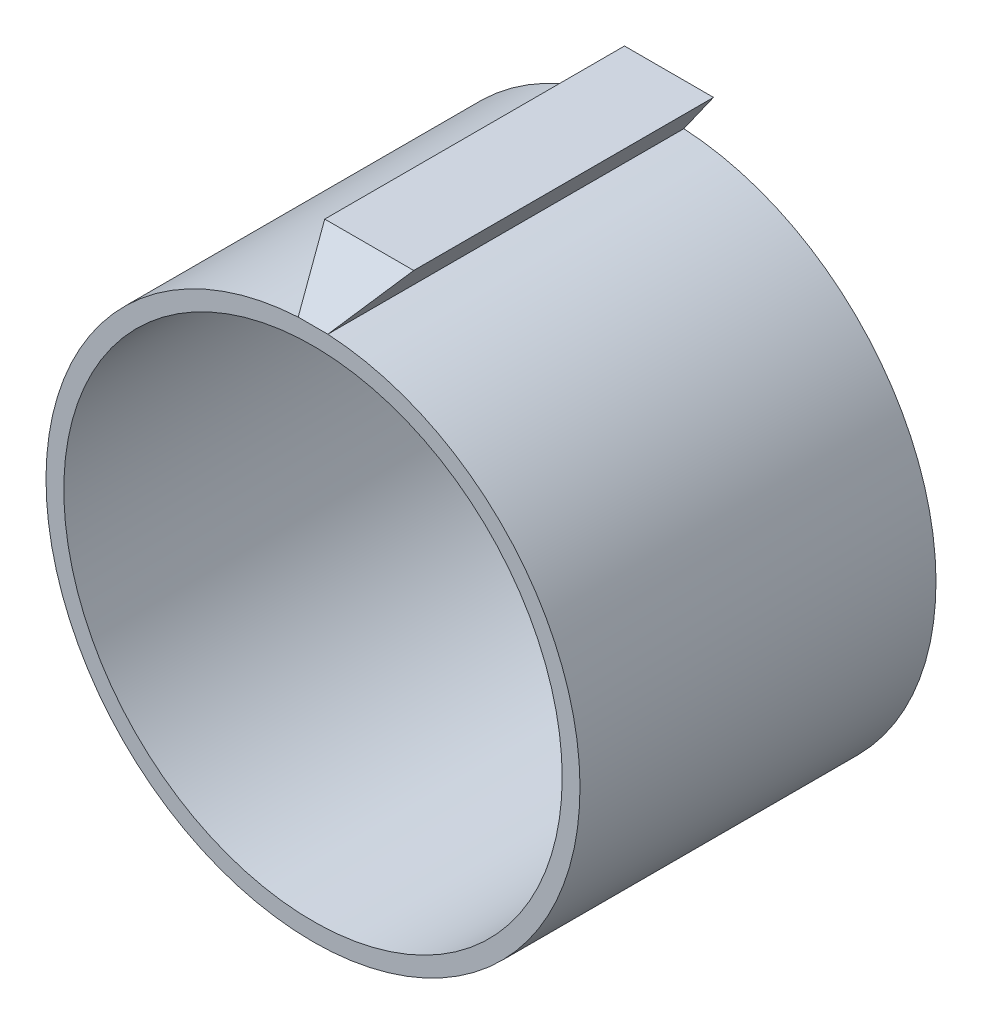
ISO-10303-21;
HEADER;
FILE_DESCRIPTION(('STEP AP214'),'2;1');
FILE_NAME('part.step','',(''),(''),'','','');
FILE_SCHEMA(('AUTOMOTIVE_DESIGN { 1 0 10303 214 1 1 1 1 }'));
ENDSEC;
DATA;
#1=APPLICATION_CONTEXT('core data for automotive mechanical design processes');
#2=APPLICATION_PROTOCOL_DEFINITION('international standard','automotive_design',2000,#1);
#3=PRODUCT_CONTEXT('',#1,'mechanical');
#4=PRODUCT('Part','Part','',(#3));
#5=PRODUCT_RELATED_PRODUCT_CATEGORY('part','',(#4));
#6=PRODUCT_DEFINITION_FORMATION('','',#4);
#7=PRODUCT_DEFINITION_CONTEXT('part definition',#1,'design');
#8=PRODUCT_DEFINITION('design','',#6,#7);
#9=PRODUCT_DEFINITION_SHAPE('','',#8);
#10=(LENGTH_UNIT() NAMED_UNIT(*) SI_UNIT(.MILLI.,.METRE.));
#11=(NAMED_UNIT(*) PLANE_ANGLE_UNIT() SI_UNIT($,.RADIAN.));
#12=(NAMED_UNIT(*) SI_UNIT($,.STERADIAN.) SOLID_ANGLE_UNIT());
#13=UNCERTAINTY_MEASURE_WITH_UNIT(LENGTH_MEASURE(1.E-05),#10,'distance_accuracy_value','');
#14=(GEOMETRIC_REPRESENTATION_CONTEXT(3) GLOBAL_UNCERTAINTY_ASSIGNED_CONTEXT((#13)) GLOBAL_UNIT_ASSIGNED_CONTEXT((#10,
#11,#12)) REPRESENTATION_CONTEXT('',''));
#15=CARTESIAN_POINT('',(0.,0.,0.));
#16=DIRECTION('',(0.,0.,1.));
#17=DIRECTION('',(1.,0.,0.));
#18=AXIS2_PLACEMENT_3D('',#15,#16,#17);
#19=CARTESIAN_POINT('',(-19.5155887901432,13.8026692162604,60.));
#20=DIRECTION('',(0.816436149697724,-0.577435722368088,0.));
#21=DIRECTION('',(0.577435722368088,0.816436149697724,0.));
#22=AXIS2_PLACEMENT_3D('',#19,#20,#21);
#23=PLANE('',#22);
#24=DIRECTION('',(0.,0.,-1.));
#25=VECTOR('',#24,1.);
#26=CARTESIAN_POINT('',(7.5,52.,60.));
#27=LINE('',#26,#25);
#28=CARTESIAN_POINT('',(7.5,52.,50.5251412040226));
#29=VERTEX_POINT('',#28);
#30=CARTESIAN_POINT('',(7.5,52.,0.));
#31=VERTEX_POINT('',#30);
#32=EDGE_CURVE('E43',#29,#31,#27,.T.);
#33=ORIENTED_EDGE('',*,*,#32,.F.);
#34=DIRECTION('',(0.389543803651656,0.550775836811201,-0.738174506889477));
#35=VECTOR('',#34,1.);
#36=CARTESIAN_POINT('',(4.87488787110196,48.2883549527334,55.4996545530059));
#37=LINE('',#36,#35);
#38=CARTESIAN_POINT('',(2.5,44.9305018890286,60.));
#39=VERTEX_POINT('',#38);
#40=EDGE_CURVE('E109',#39,#29,#37,.T.);
#41=ORIENTED_EDGE('',*,*,#40,.F.);
#42=DIRECTION('',(0.,0.,-1.));
#43=VECTOR('',#42,1.);
#44=CARTESIAN_POINT('',(2.5,44.9305018890286,60.));
#45=LINE('',#44,#43);
#46=CARTESIAN_POINT('',(2.5,44.9305018890286,0.));
#47=VERTEX_POINT('',#46);
#48=EDGE_CURVE('E11',#39,#47,#45,.T.);
#49=ORIENTED_EDGE('',*,*,#48,.T.);
#50=DIRECTION('',(-0.577435722368088,-0.816436149697724,0.));
#51=VECTOR('',#50,1.);
#52=CARTESIAN_POINT('',(-19.5155887901432,13.8026692162604,0.));
#53=LINE('',#52,#51);
#54=EDGE_CURVE('E92',#31,#47,#53,.T.);
#55=ORIENTED_EDGE('',*,*,#54,.F.);
#56=EDGE_LOOP('',(#33,#41,#49,#55));
#57=FACE_BOUND('',#56,.T.);
#58=ADVANCED_FACE('F34',(#57),#23,.T.);
#59=CARTESIAN_POINT('',(0.,52.,60.));
#60=DIRECTION('',(0.,1.,0.));
#61=DIRECTION('',(0.,0.,1.));
#62=AXIS2_PLACEMENT_3D('',#59,#60,#61);
#63=PLANE('',#62);
#64=DIRECTION('',(0.,0.,-1.));
#65=VECTOR('',#64,1.);
#66=CARTESIAN_POINT('',(-7.5,52.,60.));
#67=LINE('',#66,#65);
#68=CARTESIAN_POINT('',(-7.5,52.,50.5251412040226));
#69=VERTEX_POINT('',#68);
#70=CARTESIAN_POINT('',(-7.5,52.,0.));
#71=VERTEX_POINT('',#70);
#72=EDGE_CURVE('E67',#69,#71,#67,.T.);
#73=ORIENTED_EDGE('',*,*,#72,.F.);
#74=DIRECTION('',(-1.,0.,0.));
#75=VECTOR('',#74,1.);
#76=CARTESIAN_POINT('',(18.150582577936,52.,50.5251412040226));
#77=LINE('',#76,#75);
#78=EDGE_CURVE('E111',#29,#69,#77,.T.);
#79=ORIENTED_EDGE('',*,*,#78,.F.);
#80=ORIENTED_EDGE('',*,*,#32,.T.);
#81=DIRECTION('',(1.,0.,0.));
#82=VECTOR('',#81,1.);
#83=CARTESIAN_POINT('',(0.,52.,0.));
#84=LINE('',#83,#82);
#85=EDGE_CURVE('E84',#71,#31,#84,.T.);
#86=ORIENTED_EDGE('',*,*,#85,.F.);
#87=EDGE_LOOP('',(#73,#79,#80,#86));
#88=FACE_BOUND('',#87,.T.);
#89=ADVANCED_FACE('F89',(#88),#63,.T.);
#90=CARTESIAN_POINT('',(19.5155887901432,13.8026692162604,60.));
#91=DIRECTION('',(0.816436149697724,0.577435722368088,0.));
#92=DIRECTION('',(-0.577435722368088,0.816436149697724,0.));
#93=AXIS2_PLACEMENT_3D('',#90,#91,#92);
#94=PLANE('',#93);
#95=DIRECTION('',(0.389543803651656,-0.550775836811201,0.738174506889477));
#96=VECTOR('',#95,1.);
#97=CARTESIAN_POINT('',(-4.87488787110196,48.2883549527334,55.4996545530059));
#98=LINE('',#97,#96);
#99=CARTESIAN_POINT('',(-2.5,44.9305018890286,60.));
#100=VERTEX_POINT('',#99);
#101=EDGE_CURVE('E50',#69,#100,#98,.T.);
#102=ORIENTED_EDGE('',*,*,#101,.F.);
#103=ORIENTED_EDGE('',*,*,#72,.T.);
#104=DIRECTION('',(0.577435722368088,-0.816436149697724,0.));
#105=VECTOR('',#104,1.);
#106=CARTESIAN_POINT('',(19.5155887901432,13.8026692162604,0.));
#107=LINE('',#106,#105);
#108=CARTESIAN_POINT('',(-2.5,44.9305018890286,0.));
#109=VERTEX_POINT('',#108);
#110=EDGE_CURVE('E71',#71,#109,#107,.T.);
#111=ORIENTED_EDGE('',*,*,#110,.T.);
#112=DIRECTION('',(0.,0.,-1.));
#113=VECTOR('',#112,1.);
#114=CARTESIAN_POINT('',(-2.5,44.9305018890286,60.));
#115=LINE('',#114,#113);
#116=EDGE_CURVE('E77',#100,#109,#115,.T.);
#117=ORIENTED_EDGE('',*,*,#116,.F.);
#118=EDGE_LOOP('',(#102,#103,#111,#117));
#119=FACE_BOUND('',#118,.T.);
#120=ADVANCED_FACE('F69',(#119),#94,.F.);
#121=CARTESIAN_POINT('',(0.,0.,60.));
#122=DIRECTION('',(0.,0.,1.));
#123=DIRECTION('',(1.,0.,0.));
#124=AXIS2_PLACEMENT_3D('',#121,#122,#123);
#125=PLANE('',#124);
#126=CARTESIAN_POINT('',(0.,0.,60.));
#127=DIRECTION('',(0.,0.,1.));
#128=DIRECTION('',(1.,0.,0.));
#129=AXIS2_PLACEMENT_3D('',#126,#127,#128);
#130=CIRCLE('',#129,42.);
#131=CARTESIAN_POINT('',(42.,0.,60.));
#132=VERTEX_POINT('',#131);
#133=EDGE_CURVE('E100',#132,#132,#130,.T.);
#134=ORIENTED_EDGE('',*,*,#133,.F.);
#135=EDGE_LOOP('',(#134));
#136=FACE_BOUND('',#135,.T.);
#137=CARTESIAN_POINT('',(0.,0.,60.));
#138=DIRECTION('',(0.,0.,1.));
#139=DIRECTION('',(1.,0.,0.));
#140=AXIS2_PLACEMENT_3D('',#137,#138,#139);
#141=CIRCLE('',#140,45.);
#142=EDGE_CURVE('E99',#39,#100,#141,.F.);
#143=ORIENTED_EDGE('',*,*,#142,.F.);
#144=DIRECTION('',(-1.,0.,0.));
#145=VECTOR('',#144,1.);
#146=CARTESIAN_POINT('',(18.150582577936,44.9305018890286,60.));
#147=LINE('',#146,#145);
#148=EDGE_CURVE('E114',#39,#100,#147,.T.);
#149=ORIENTED_EDGE('',*,*,#148,.T.);
#150=EDGE_LOOP('',(#143,#149));
#151=FACE_BOUND('',#150,.T.);
#152=ADVANCED_FACE('F119',(#136,#151),#125,.T.);
#153=CARTESIAN_POINT('',(0.,0.,60.));
#154=DIRECTION('',(0.,0.,-1.));
#155=DIRECTION('',(-1.,0.,0.));
#156=AXIS2_PLACEMENT_3D('',#153,#154,#155);
#157=CYLINDRICAL_SURFACE('',#156,45.);
#158=CARTESIAN_POINT('',(0.,0.,0.));
#159=DIRECTION('',(0.,0.,1.));
#160=DIRECTION('',(1.,0.,0.));
#161=AXIS2_PLACEMENT_3D('',#158,#159,#160);
#162=CIRCLE('',#161,45.);
#163=EDGE_CURVE('E86',#47,#109,#162,.F.);
#164=ORIENTED_EDGE('',*,*,#163,.F.);
#165=ORIENTED_EDGE('',*,*,#48,.F.);
#166=ORIENTED_EDGE('',*,*,#142,.T.);
#167=ORIENTED_EDGE('',*,*,#116,.T.);
#168=EDGE_LOOP('',(#164,#165,#166,#167));
#169=FACE_BOUND('',#168,.T.);
#170=ADVANCED_FACE('F36',(#169),#157,.T.);
#171=CARTESIAN_POINT('',(0.,0.,60.));
#172=DIRECTION('',(0.,0.,-1.));
#173=DIRECTION('',(-1.,0.,0.));
#174=AXIS2_PLACEMENT_3D('',#171,#172,#173);
#175=CYLINDRICAL_SURFACE('',#174,42.);
#176=ORIENTED_EDGE('',*,*,#133,.T.);
#177=EDGE_LOOP('',(#176));
#178=FACE_BOUND('',#177,.T.);
#179=CARTESIAN_POINT('',(0.,0.,0.));
#180=DIRECTION('',(0.,0.,1.));
#181=DIRECTION('',(1.,0.,0.));
#182=AXIS2_PLACEMENT_3D('',#179,#180,#181);
#183=CIRCLE('',#182,42.);
#184=CARTESIAN_POINT('',(42.,0.,0.));
#185=VERTEX_POINT('',#184);
#186=EDGE_CURVE('E87',#185,#185,#183,.T.);
#187=ORIENTED_EDGE('',*,*,#186,.F.);
#188=EDGE_LOOP('',(#187));
#189=FACE_BOUND('',#188,.T.);
#190=ADVANCED_FACE('F129',(#178,#189),#175,.F.);
#191=CARTESIAN_POINT('',(0.,0.,0.));
#192=DIRECTION('',(0.,0.,1.));
#193=DIRECTION('',(1.,0.,0.));
#194=AXIS2_PLACEMENT_3D('',#191,#192,#193);
#195=PLANE('',#194);
#196=ORIENTED_EDGE('',*,*,#163,.T.);
#197=ORIENTED_EDGE('',*,*,#110,.F.);
#198=ORIENTED_EDGE('',*,*,#85,.T.);
#199=ORIENTED_EDGE('',*,*,#54,.T.);
#200=EDGE_LOOP('',(#196,#197,#198,#199));
#201=FACE_BOUND('',#200,.T.);
#202=ORIENTED_EDGE('',*,*,#186,.T.);
#203=EDGE_LOOP('',(#202));
#204=FACE_BOUND('',#203,.T.);
#205=ADVANCED_FACE('F81',(#201,#204),#195,.F.);
#206=CARTESIAN_POINT('',(18.150582577936,44.9305018890286,60.));
#207=DIRECTION('',(0.,0.801485497627563,0.598014211447101));
#208=DIRECTION('',(0.,-0.598014211447101,0.801485497627563));
#209=AXIS2_PLACEMENT_3D('',#206,#207,#208);
#210=PLANE('',#209);
#211=ORIENTED_EDGE('',*,*,#40,.T.);
#212=ORIENTED_EDGE('',*,*,#78,.T.);
#213=ORIENTED_EDGE('',*,*,#101,.T.);
#214=ORIENTED_EDGE('',*,*,#148,.F.);
#215=EDGE_LOOP('',(#211,#212,#213,#214));
#216=FACE_BOUND('',#215,.T.);
#217=ADVANCED_FACE('F123',(#216),#210,.T.);
#218=CLOSED_SHELL('',(#58,#89,#120,#152,#170,#190,#205,#217));
#219=MANIFOLD_SOLID_BREP('B2',#218);
#220=ADVANCED_BREP_SHAPE_REPRESENTATION('',(#18,#219),#14);
#221=SHAPE_DEFINITION_REPRESENTATION(#9,#220);
ENDSEC;
END-ISO-10303-21;
